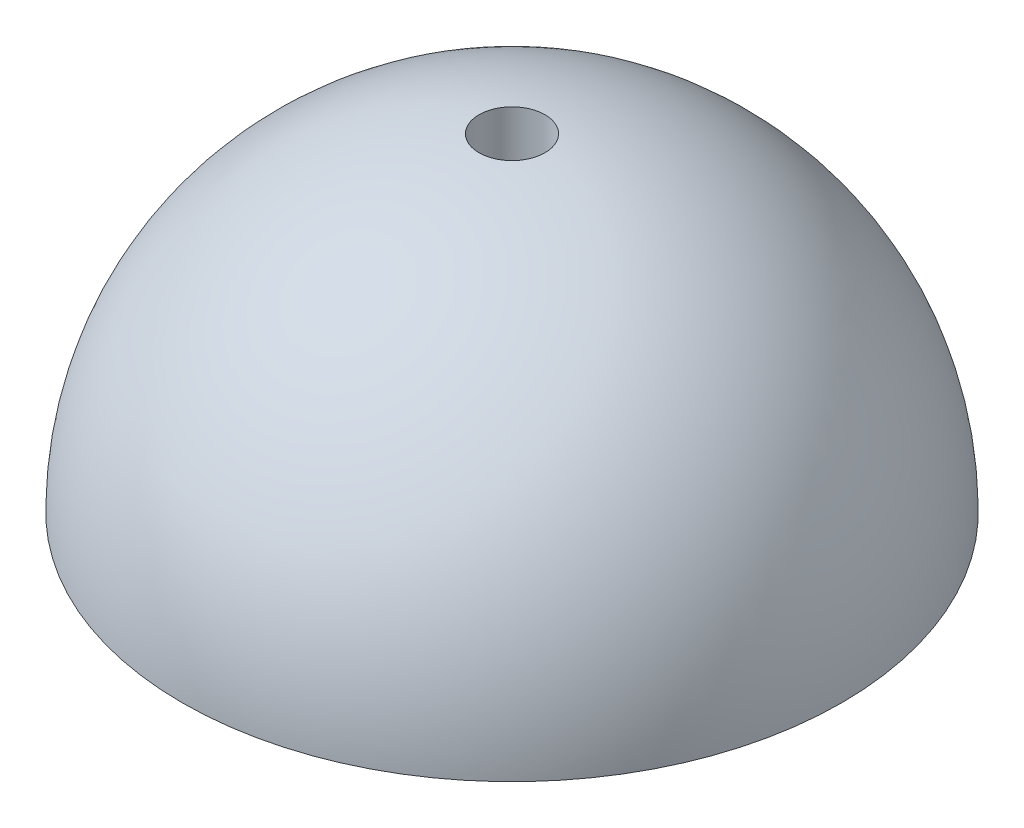
ISO-10303-21;
HEADER;
FILE_DESCRIPTION(('STEP AP214'),'2;1');
FILE_NAME('part.step','',(''),(''),'','','');
FILE_SCHEMA(('AUTOMOTIVE_DESIGN { 1 0 10303 214 1 1 1 1 }'));
ENDSEC;
DATA;
#1=APPLICATION_CONTEXT('core data for automotive mechanical design processes');
#2=APPLICATION_PROTOCOL_DEFINITION('international standard','automotive_design',2000,#1);
#3=PRODUCT_CONTEXT('',#1,'mechanical');
#4=PRODUCT('Part','Part','',(#3));
#5=PRODUCT_RELATED_PRODUCT_CATEGORY('part','',(#4));
#6=PRODUCT_DEFINITION_FORMATION('','',#4);
#7=PRODUCT_DEFINITION_CONTEXT('part definition',#1,'design');
#8=PRODUCT_DEFINITION('design','',#6,#7);
#9=PRODUCT_DEFINITION_SHAPE('','',#8);
#10=(LENGTH_UNIT() NAMED_UNIT(*) SI_UNIT(.MILLI.,.METRE.));
#11=(NAMED_UNIT(*) PLANE_ANGLE_UNIT() SI_UNIT($,.RADIAN.));
#12=(NAMED_UNIT(*) SI_UNIT($,.STERADIAN.) SOLID_ANGLE_UNIT());
#13=UNCERTAINTY_MEASURE_WITH_UNIT(LENGTH_MEASURE(1.E-05),#10,'distance_accuracy_value','');
#14=(GEOMETRIC_REPRESENTATION_CONTEXT(3) GLOBAL_UNCERTAINTY_ASSIGNED_CONTEXT((#13)) GLOBAL_UNIT_ASSIGNED_CONTEXT((#10,
#11,#12)) REPRESENTATION_CONTEXT('',''));
#15=CARTESIAN_POINT('',(0.,0.,0.));
#16=DIRECTION('',(0.,0.,1.));
#17=DIRECTION('',(1.,0.,0.));
#18=AXIS2_PLACEMENT_3D('',#15,#16,#17);
#19=CARTESIAN_POINT('',(0.,0.,0.));
#20=DIRECTION('',(0.,1.,0.));
#21=DIRECTION('',(-1.,0.,0.));
#22=AXIS2_PLACEMENT_3D('',#19,#20,#21);
#23=PLANE('',#22);
#24=CARTESIAN_POINT('',(0.,0.,0.));
#25=DIRECTION('',(0.,-1.,0.));
#26=DIRECTION('',(1.,0.,0.));
#27=AXIS2_PLACEMENT_3D('',#24,#25,#26);
#28=CIRCLE('',#27,1.);
#29=CARTESIAN_POINT('',(1.,0.,0.));
#30=VERTEX_POINT('',#29);
#31=EDGE_CURVE('E49',#30,#30,#28,.T.);
#32=ORIENTED_EDGE('',*,*,#31,.F.);
#33=EDGE_LOOP('',(#32));
#34=FACE_BOUND('',#33,.T.);
#35=CARTESIAN_POINT('',(0.,0.,0.));
#36=DIRECTION('',(0.,1.,0.));
#37=DIRECTION('',(-1.,0.,0.));
#38=AXIS2_PLACEMENT_3D('',#35,#36,#37);
#39=CIRCLE('',#38,10.);
#40=CARTESIAN_POINT('',(-10.,0.,0.));
#41=VERTEX_POINT('',#40);
#42=EDGE_CURVE('E10',#41,#41,#39,.T.);
#43=ORIENTED_EDGE('',*,*,#42,.F.);
#44=EDGE_LOOP('',(#43));
#45=FACE_BOUND('',#44,.T.);
#46=ADVANCED_FACE('F37',(#34,#45),#23,.F.);
#47=CARTESIAN_POINT('',(0.,0.,0.));
#48=DIRECTION('',(0.,1.,0.));
#49=DIRECTION('',(1.,0.,0.));
#50=AXIS2_PLACEMENT_3D('',#47,#48,#49);
#51=SPHERICAL_SURFACE('',#50,10.);
#52=CARTESIAN_POINT('',(0.,9.9498743710662,0.));
#53=DIRECTION('',(0.,-1.,0.));
#54=DIRECTION('',(1.,0.,0.));
#55=AXIS2_PLACEMENT_3D('',#52,#53,#54);
#56=CIRCLE('',#55,1.);
#57=CARTESIAN_POINT('',(1.,9.9498743710662,0.));
#58=VERTEX_POINT('',#57);
#59=EDGE_CURVE('E44',#58,#58,#56,.F.);
#60=ORIENTED_EDGE('',*,*,#59,.F.);
#61=EDGE_LOOP('',(#60));
#62=FACE_BOUND('',#61,.T.);
#63=ORIENTED_EDGE('',*,*,#42,.T.);
#64=EDGE_LOOP('',(#63));
#65=FACE_BOUND('',#64,.T.);
#66=ADVANCED_FACE('F61',(#62,#65),#51,.T.);
#67=CARTESIAN_POINT('',(0.,10.001,0.));
#68=DIRECTION('',(0.,-1.,0.));
#69=DIRECTION('',(1.,0.,0.));
#70=AXIS2_PLACEMENT_3D('',#67,#68,#69);
#71=CYLINDRICAL_SURFACE('',#70,1.);
#72=ORIENTED_EDGE('',*,*,#31,.T.);
#73=EDGE_LOOP('',(#72));
#74=FACE_BOUND('',#73,.T.);
#75=ORIENTED_EDGE('',*,*,#59,.T.);
#76=EDGE_LOOP('',(#75));
#77=FACE_BOUND('',#76,.T.);
#78=ADVANCED_FACE('F57',(#74,#77),#71,.F.);
#79=CLOSED_SHELL('',(#46,#66,#78));
#80=MANIFOLD_SOLID_BREP('B2',#79);
#81=ADVANCED_BREP_SHAPE_REPRESENTATION('',(#18,#80),#14);
#82=SHAPE_DEFINITION_REPRESENTATION(#9,#81);
ENDSEC;
END-ISO-10303-21;
